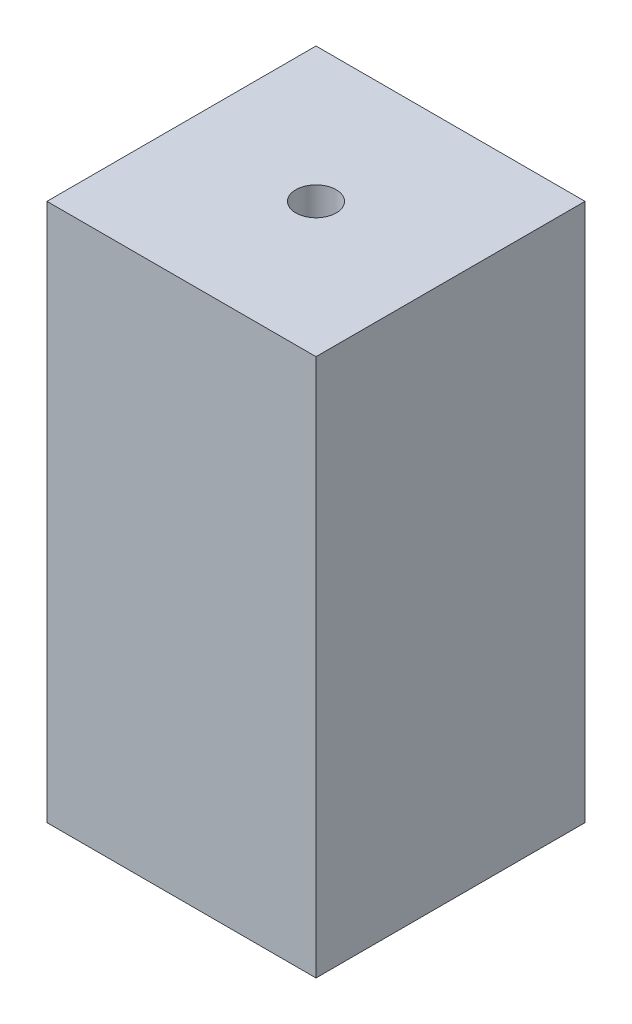
ISO-10303-21;
HEADER;
FILE_DESCRIPTION(('STEP AP214'),'2;1');
FILE_NAME('part.step','',(''),(''),'','','');
FILE_SCHEMA(('AUTOMOTIVE_DESIGN { 1 0 10303 214 1 1 1 1 }'));
ENDSEC;
DATA;
#1=APPLICATION_CONTEXT('core data for automotive mechanical design processes');
#2=APPLICATION_PROTOCOL_DEFINITION('international standard','automotive_design',2000,#1);
#3=PRODUCT_CONTEXT('',#1,'mechanical');
#4=PRODUCT('Part','Part','',(#3));
#5=PRODUCT_RELATED_PRODUCT_CATEGORY('part','',(#4));
#6=PRODUCT_DEFINITION_FORMATION('','',#4);
#7=PRODUCT_DEFINITION_CONTEXT('part definition',#1,'design');
#8=PRODUCT_DEFINITION('design','',#6,#7);
#9=PRODUCT_DEFINITION_SHAPE('','',#8);
#10=(LENGTH_UNIT() NAMED_UNIT(*) SI_UNIT(.MILLI.,.METRE.));
#11=(NAMED_UNIT(*) PLANE_ANGLE_UNIT() SI_UNIT($,.RADIAN.));
#12=(NAMED_UNIT(*) SI_UNIT($,.STERADIAN.) SOLID_ANGLE_UNIT());
#13=UNCERTAINTY_MEASURE_WITH_UNIT(LENGTH_MEASURE(1.E-05),#10,'distance_accuracy_value','');
#14=(GEOMETRIC_REPRESENTATION_CONTEXT(3) GLOBAL_UNCERTAINTY_ASSIGNED_CONTEXT((#13)) GLOBAL_UNIT_ASSIGNED_CONTEXT((#10,
#11,#12)) REPRESENTATION_CONTEXT('',''));
#15=CARTESIAN_POINT('',(0.,0.,0.));
#16=DIRECTION('',(0.,0.,1.));
#17=DIRECTION('',(1.,0.,0.));
#18=AXIS2_PLACEMENT_3D('',#15,#16,#17);
#19=CARTESIAN_POINT('',(0.,20.,0.));
#20=DIRECTION('',(1.,0.,0.));
#21=DIRECTION('',(0.,0.,-1.));
#22=AXIS2_PLACEMENT_3D('',#19,#20,#21);
#23=PLANE('',#22);
#24=DIRECTION('',(0.,0.,1.));
#25=VECTOR('',#24,1.);
#26=CARTESIAN_POINT('',(0.,0.,0.));
#27=LINE('',#26,#25);
#28=CARTESIAN_POINT('',(0.,0.,-10.));
#29=VERTEX_POINT('',#28);
#30=CARTESIAN_POINT('',(0.,0.,0.));
#31=VERTEX_POINT('',#30);
#32=EDGE_CURVE('E120',#29,#31,#27,.T.);
#33=ORIENTED_EDGE('',*,*,#32,.T.);
#34=DIRECTION('',(0.,-1.,0.));
#35=VECTOR('',#34,1.);
#36=CARTESIAN_POINT('',(0.,20.,0.));
#37=LINE('',#36,#35);
#38=CARTESIAN_POINT('',(0.,20.,0.));
#39=VERTEX_POINT('',#38);
#40=EDGE_CURVE('E11',#39,#31,#37,.T.);
#41=ORIENTED_EDGE('',*,*,#40,.F.);
#42=DIRECTION('',(0.,0.,1.));
#43=VECTOR('',#42,1.);
#44=CARTESIAN_POINT('',(0.,20.,0.));
#45=LINE('',#44,#43);
#46=CARTESIAN_POINT('',(0.,20.,-10.));
#47=VERTEX_POINT('',#46);
#48=EDGE_CURVE('E100',#47,#39,#45,.T.);
#49=ORIENTED_EDGE('',*,*,#48,.F.);
#50=DIRECTION('',(0.,-1.,0.));
#51=VECTOR('',#50,1.);
#52=CARTESIAN_POINT('',(0.,20.,-10.));
#53=LINE('',#52,#51);
#54=EDGE_CURVE('E116',#47,#29,#53,.T.);
#55=ORIENTED_EDGE('',*,*,#54,.T.);
#56=EDGE_LOOP('',(#33,#41,#49,#55));
#57=FACE_BOUND('',#56,.T.);
#58=ADVANCED_FACE('F47',(#57),#23,.F.);
#59=CARTESIAN_POINT('',(0.,20.,0.));
#60=DIRECTION('',(0.,0.,-1.));
#61=DIRECTION('',(-1.,0.,0.));
#62=AXIS2_PLACEMENT_3D('',#59,#60,#61);
#63=PLANE('',#62);
#64=DIRECTION('',(1.,0.,0.));
#65=VECTOR('',#64,1.);
#66=CARTESIAN_POINT('',(0.,0.,0.));
#67=LINE('',#66,#65);
#68=CARTESIAN_POINT('',(10.,0.,0.));
#69=VERTEX_POINT('',#68);
#70=EDGE_CURVE('E105',#31,#69,#67,.T.);
#71=ORIENTED_EDGE('',*,*,#70,.T.);
#72=DIRECTION('',(0.,-1.,0.));
#73=VECTOR('',#72,1.);
#74=CARTESIAN_POINT('',(10.,20.,0.));
#75=LINE('',#74,#73);
#76=CARTESIAN_POINT('',(10.,20.,0.));
#77=VERTEX_POINT('',#76);
#78=EDGE_CURVE('E57',#77,#69,#75,.T.);
#79=ORIENTED_EDGE('',*,*,#78,.F.);
#80=DIRECTION('',(1.,0.,0.));
#81=VECTOR('',#80,1.);
#82=CARTESIAN_POINT('',(0.,20.,0.));
#83=LINE('',#82,#81);
#84=EDGE_CURVE('E95',#39,#77,#83,.T.);
#85=ORIENTED_EDGE('',*,*,#84,.F.);
#86=ORIENTED_EDGE('',*,*,#40,.T.);
#87=EDGE_LOOP('',(#71,#79,#85,#86));
#88=FACE_BOUND('',#87,.T.);
#89=ADVANCED_FACE('F104',(#88),#63,.F.);
#90=CARTESIAN_POINT('',(10.,20.,0.));
#91=DIRECTION('',(-1.,0.,0.));
#92=DIRECTION('',(0.,0.,1.));
#93=AXIS2_PLACEMENT_3D('',#90,#91,#92);
#94=PLANE('',#93);
#95=DIRECTION('',(0.,0.,-1.));
#96=VECTOR('',#95,1.);
#97=CARTESIAN_POINT('',(10.,0.,0.));
#98=LINE('',#97,#96);
#99=CARTESIAN_POINT('',(10.,0.,-10.));
#100=VERTEX_POINT('',#99);
#101=EDGE_CURVE('E82',#69,#100,#98,.T.);
#102=ORIENTED_EDGE('',*,*,#101,.T.);
#103=DIRECTION('',(0.,-1.,0.));
#104=VECTOR('',#103,1.);
#105=CARTESIAN_POINT('',(10.,20.,-10.));
#106=LINE('',#105,#104);
#107=CARTESIAN_POINT('',(10.,20.,-10.));
#108=VERTEX_POINT('',#107);
#109=EDGE_CURVE('E107',#108,#100,#106,.T.);
#110=ORIENTED_EDGE('',*,*,#109,.F.);
#111=DIRECTION('',(0.,0.,-1.));
#112=VECTOR('',#111,1.);
#113=CARTESIAN_POINT('',(10.,20.,0.));
#114=LINE('',#113,#112);
#115=EDGE_CURVE('E98',#77,#108,#114,.T.);
#116=ORIENTED_EDGE('',*,*,#115,.F.);
#117=ORIENTED_EDGE('',*,*,#78,.T.);
#118=EDGE_LOOP('',(#102,#110,#116,#117));
#119=FACE_BOUND('',#118,.T.);
#120=ADVANCED_FACE('F109',(#119),#94,.F.);
#121=CARTESIAN_POINT('',(0.,20.,-10.));
#122=DIRECTION('',(0.,0.,1.));
#123=DIRECTION('',(1.,0.,0.));
#124=AXIS2_PLACEMENT_3D('',#121,#122,#123);
#125=PLANE('',#124);
#126=DIRECTION('',(-1.,0.,0.));
#127=VECTOR('',#126,1.);
#128=CARTESIAN_POINT('',(0.,0.,-10.));
#129=LINE('',#128,#127);
#130=EDGE_CURVE('E88',#100,#29,#129,.T.);
#131=ORIENTED_EDGE('',*,*,#130,.T.);
#132=ORIENTED_EDGE('',*,*,#54,.F.);
#133=DIRECTION('',(-1.,0.,0.));
#134=VECTOR('',#133,1.);
#135=CARTESIAN_POINT('',(0.,20.,-10.));
#136=LINE('',#135,#134);
#137=EDGE_CURVE('E65',#108,#47,#136,.T.);
#138=ORIENTED_EDGE('',*,*,#137,.F.);
#139=ORIENTED_EDGE('',*,*,#109,.T.);
#140=EDGE_LOOP('',(#131,#132,#138,#139));
#141=FACE_BOUND('',#140,.T.);
#142=ADVANCED_FACE('F133',(#141),#125,.F.);
#143=CARTESIAN_POINT('',(0.,20.,0.));
#144=DIRECTION('',(0.,-1.,0.));
#145=DIRECTION('',(0.,0.,-1.));
#146=AXIS2_PLACEMENT_3D('',#143,#144,#145);
#147=PLANE('',#146);
#148=CARTESIAN_POINT('',(5.,20.,-5.));
#149=DIRECTION('',(0.,1.,0.));
#150=DIRECTION('',(0.,0.,1.));
#151=AXIS2_PLACEMENT_3D('',#148,#149,#150);
#152=CIRCLE('',#151,0.75);
#153=CARTESIAN_POINT('',(5.,20.,-4.25));
#154=VERTEX_POINT('',#153);
#155=EDGE_CURVE('E141',#154,#154,#152,.T.);
#156=ORIENTED_EDGE('',*,*,#155,.F.);
#157=EDGE_LOOP('',(#156));
#158=FACE_BOUND('',#157,.T.);
#159=ORIENTED_EDGE('',*,*,#48,.T.);
#160=ORIENTED_EDGE('',*,*,#84,.T.);
#161=ORIENTED_EDGE('',*,*,#115,.T.);
#162=ORIENTED_EDGE('',*,*,#137,.T.);
#163=EDGE_LOOP('',(#159,#160,#161,#162));
#164=FACE_BOUND('',#163,.T.);
#165=ADVANCED_FACE('F96',(#158,#164),#147,.F.);
#166=CARTESIAN_POINT('',(0.,0.,0.));
#167=DIRECTION('',(0.,-1.,0.));
#168=DIRECTION('',(0.,0.,-1.));
#169=AXIS2_PLACEMENT_3D('',#166,#167,#168);
#170=PLANE('',#169);
#171=CARTESIAN_POINT('',(5.,0.,-5.));
#172=DIRECTION('',(0.,-1.,0.));
#173=DIRECTION('',(0.,0.,-1.));
#174=AXIS2_PLACEMENT_3D('',#171,#172,#173);
#175=CIRCLE('',#174,0.75);
#176=CARTESIAN_POINT('',(5.,0.,-5.75));
#177=VERTEX_POINT('',#176);
#178=EDGE_CURVE('E50',#177,#177,#175,.T.);
#179=ORIENTED_EDGE('',*,*,#178,.F.);
#180=EDGE_LOOP('',(#179));
#181=FACE_BOUND('',#180,.T.);
#182=ORIENTED_EDGE('',*,*,#32,.F.);
#183=ORIENTED_EDGE('',*,*,#130,.F.);
#184=ORIENTED_EDGE('',*,*,#101,.F.);
#185=ORIENTED_EDGE('',*,*,#70,.F.);
#186=EDGE_LOOP('',(#182,#183,#184,#185));
#187=FACE_BOUND('',#186,.T.);
#188=ADVANCED_FACE('F136',(#181,#187),#170,.T.);
#189=CARTESIAN_POINT('',(5.,-0.999999999999997,-5.));
#190=DIRECTION('',(0.,1.,0.));
#191=DIRECTION('',(0.,0.,1.));
#192=AXIS2_PLACEMENT_3D('',#189,#190,#191);
#193=CYLINDRICAL_SURFACE('',#192,0.75);
#194=ORIENTED_EDGE('',*,*,#178,.T.);
#195=EDGE_LOOP('',(#194));
#196=FACE_BOUND('',#195,.T.);
#197=ORIENTED_EDGE('',*,*,#155,.T.);
#198=EDGE_LOOP('',(#197));
#199=FACE_BOUND('',#198,.T.);
#200=ADVANCED_FACE('F151',(#196,#199),#193,.F.);
#201=CLOSED_SHELL('',(#58,#89,#120,#142,#165,#188,#200));
#202=MANIFOLD_SOLID_BREP('B2',#201);
#203=ADVANCED_BREP_SHAPE_REPRESENTATION('',(#18,#202),#14);
#204=SHAPE_DEFINITION_REPRESENTATION(#9,#203);
ENDSEC;
END-ISO-10303-21;
